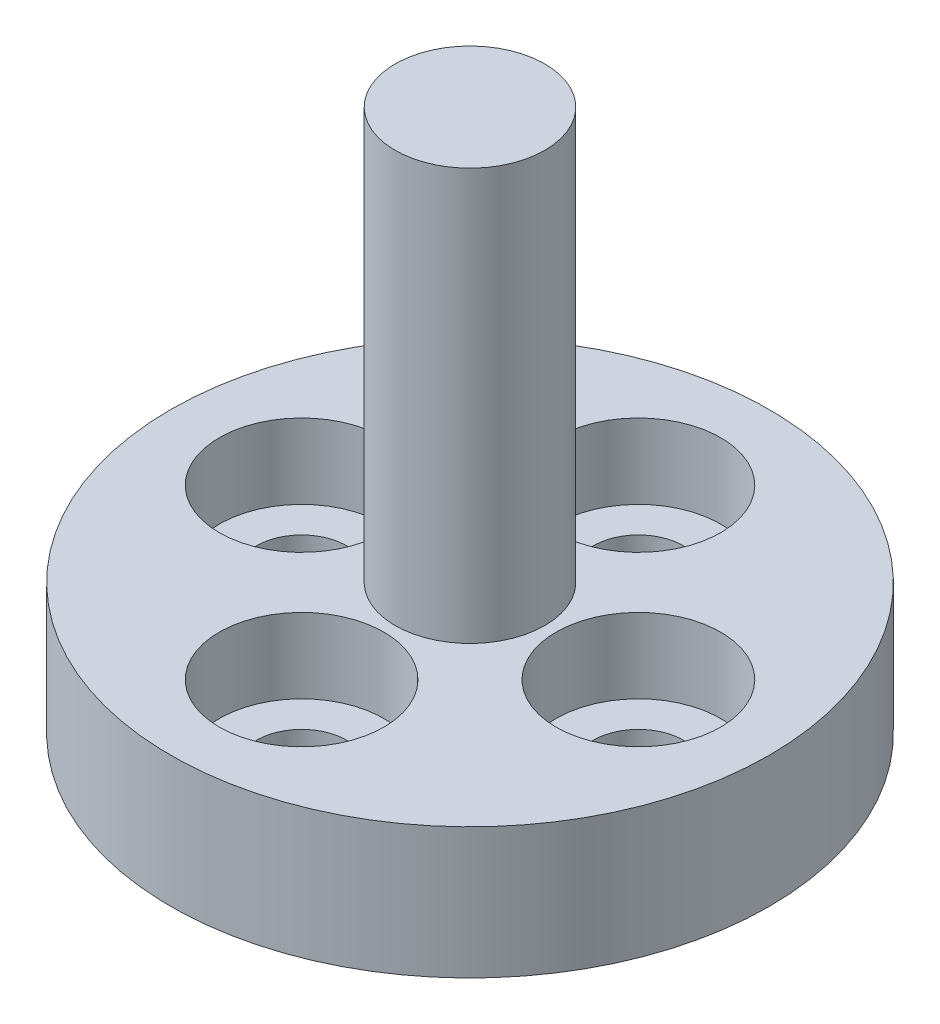
ISO-10303-21;
HEADER;
FILE_DESCRIPTION(('STEP AP214'),'2;1');
FILE_NAME('part.step','',(''),(''),'','','');
FILE_SCHEMA(('AUTOMOTIVE_DESIGN { 1 0 10303 214 1 1 1 1 }'));
ENDSEC;
DATA;
#1=APPLICATION_CONTEXT('core data for automotive mechanical design processes');
#2=APPLICATION_PROTOCOL_DEFINITION('international standard','automotive_design',2000,#1);
#3=PRODUCT_CONTEXT('',#1,'mechanical');
#4=PRODUCT('Part','Part','',(#3));
#5=PRODUCT_RELATED_PRODUCT_CATEGORY('part','',(#4));
#6=PRODUCT_DEFINITION_FORMATION('','',#4);
#7=PRODUCT_DEFINITION_CONTEXT('part definition',#1,'design');
#8=PRODUCT_DEFINITION('design','',#6,#7);
#9=PRODUCT_DEFINITION_SHAPE('','',#8);
#10=(LENGTH_UNIT() NAMED_UNIT(*) SI_UNIT(.MILLI.,.METRE.));
#11=(NAMED_UNIT(*) PLANE_ANGLE_UNIT() SI_UNIT($,.RADIAN.));
#12=(NAMED_UNIT(*) SI_UNIT($,.STERADIAN.) SOLID_ANGLE_UNIT());
#13=UNCERTAINTY_MEASURE_WITH_UNIT(LENGTH_MEASURE(1.E-05),#10,'distance_accuracy_value','');
#14=(GEOMETRIC_REPRESENTATION_CONTEXT(3) GLOBAL_UNCERTAINTY_ASSIGNED_CONTEXT((#13)) GLOBAL_UNIT_ASSIGNED_CONTEXT((#10,
#11,#12)) REPRESENTATION_CONTEXT('',''));
#15=CARTESIAN_POINT('',(0.,0.,0.));
#16=DIRECTION('',(0.,0.,1.));
#17=DIRECTION('',(1.,0.,0.));
#18=AXIS2_PLACEMENT_3D('',#15,#16,#17);
#19=CARTESIAN_POINT('',(8.,0.,0.));
#20=DIRECTION('',(0.,-1.,0.));
#21=DIRECTION('',(1.,0.,0.));
#22=AXIS2_PLACEMENT_3D('',#19,#20,#21);
#23=PLANE('',#22);
#24=CARTESIAN_POINT('',(0.,0.,0.));
#25=DIRECTION('',(0.,-1.,0.));
#26=DIRECTION('',(1.,0.,0.));
#27=AXIS2_PLACEMENT_3D('',#24,#25,#26);
#28=CIRCLE('',#27,2.);
#29=CARTESIAN_POINT('',(2.,0.,0.));
#30=VERTEX_POINT('',#29);
#31=EDGE_CURVE('E10',#30,#30,#28,.F.);
#32=ORIENTED_EDGE('',*,*,#31,.T.);
#33=EDGE_LOOP('',(#32));
#34=FACE_BOUND('',#33,.T.);
#35=CARTESIAN_POINT('',(-4.5,0.,0.));
#36=DIRECTION('',(0.,1.,0.));
#37=DIRECTION('',(0.,0.,1.));
#38=AXIS2_PLACEMENT_3D('',#35,#36,#37);
#39=CIRCLE('',#38,1.2);
#40=CARTESIAN_POINT('',(-4.5,0.,1.2));
#41=VERTEX_POINT('',#40);
#42=EDGE_CURVE('E126',#41,#41,#39,.T.);
#43=ORIENTED_EDGE('',*,*,#42,.T.);
#44=EDGE_LOOP('',(#43));
#45=FACE_BOUND('',#44,.T.);
#46=CARTESIAN_POINT('',(0.,0.,-4.5));
#47=DIRECTION('',(0.,1.,0.));
#48=DIRECTION('',(0.,0.,1.));
#49=AXIS2_PLACEMENT_3D('',#46,#47,#48);
#50=CIRCLE('',#49,1.2);
#51=CARTESIAN_POINT('',(0.,0.,-3.3));
#52=VERTEX_POINT('',#51);
#53=EDGE_CURVE('E110',#52,#52,#50,.T.);
#54=ORIENTED_EDGE('',*,*,#53,.T.);
#55=EDGE_LOOP('',(#54));
#56=FACE_BOUND('',#55,.T.);
#57=CARTESIAN_POINT('',(4.5,0.,0.));
#58=DIRECTION('',(0.,1.,0.));
#59=DIRECTION('',(0.,0.,1.));
#60=AXIS2_PLACEMENT_3D('',#57,#58,#59);
#61=CIRCLE('',#60,1.2);
#62=CARTESIAN_POINT('',(4.5,0.,1.2));
#63=VERTEX_POINT('',#62);
#64=EDGE_CURVE('E94',#63,#63,#61,.T.);
#65=ORIENTED_EDGE('',*,*,#64,.T.);
#66=EDGE_LOOP('',(#65));
#67=FACE_BOUND('',#66,.T.);
#68=CARTESIAN_POINT('',(0.,0.,4.5));
#69=DIRECTION('',(0.,1.,0.));
#70=DIRECTION('',(0.,0.,1.));
#71=AXIS2_PLACEMENT_3D('',#68,#69,#70);
#72=CIRCLE('',#71,1.2);
#73=CARTESIAN_POINT('',(0.,0.,5.7));
#74=VERTEX_POINT('',#73);
#75=EDGE_CURVE('E78',#74,#74,#72,.T.);
#76=ORIENTED_EDGE('',*,*,#75,.T.);
#77=EDGE_LOOP('',(#76));
#78=FACE_BOUND('',#77,.T.);
#79=CARTESIAN_POINT('',(0.,0.,0.));
#80=DIRECTION('',(0.,-1.,0.));
#81=DIRECTION('',(1.,0.,0.));
#82=AXIS2_PLACEMENT_3D('',#79,#80,#81);
#83=CIRCLE('',#82,8.);
#84=CARTESIAN_POINT('',(8.,0.,0.));
#85=VERTEX_POINT('',#84);
#86=EDGE_CURVE('E74',#85,#85,#83,.T.);
#87=ORIENTED_EDGE('',*,*,#86,.T.);
#88=EDGE_LOOP('',(#87));
#89=FACE_BOUND('',#88,.T.);
#90=ADVANCED_FACE('F42',(#34,#45,#56,#67,#78,#89),#23,.T.);
#91=CARTESIAN_POINT('',(0.,14.5,0.));
#92=DIRECTION('',(0.,1.,0.));
#93=DIRECTION('',(-1.,0.,0.));
#94=AXIS2_PLACEMENT_3D('',#91,#92,#93);
#95=PLANE('',#94);
#96=CARTESIAN_POINT('',(0.,14.5,0.));
#97=DIRECTION('',(0.,-1.,0.));
#98=DIRECTION('',(1.,0.,0.));
#99=AXIS2_PLACEMENT_3D('',#96,#97,#98);
#100=CIRCLE('',#99,2.);
#101=CARTESIAN_POINT('',(2.,14.5,0.));
#102=VERTEX_POINT('',#101);
#103=EDGE_CURVE('E60',#102,#102,#100,.T.);
#104=ORIENTED_EDGE('',*,*,#103,.F.);
#105=EDGE_LOOP('',(#104));
#106=FACE_BOUND('',#105,.T.);
#107=ADVANCED_FACE('F168',(#106),#95,.T.);
#108=CARTESIAN_POINT('',(0.,0.,0.));
#109=DIRECTION('',(0.,-1.,0.));
#110=DIRECTION('',(1.,0.,0.));
#111=AXIS2_PLACEMENT_3D('',#108,#109,#110);
#112=CYLINDRICAL_SURFACE('',#111,2.);
#113=ORIENTED_EDGE('',*,*,#103,.T.);
#114=EDGE_LOOP('',(#113));
#115=FACE_BOUND('',#114,.T.);
#116=CARTESIAN_POINT('',(0.,3.5,0.));
#117=DIRECTION('',(0.,-1.,0.));
#118=DIRECTION('',(1.,0.,0.));
#119=AXIS2_PLACEMENT_3D('',#116,#117,#118);
#120=CIRCLE('',#119,2.);
#121=CARTESIAN_POINT('',(2.,3.5,0.));
#122=VERTEX_POINT('',#121);
#123=EDGE_CURVE('E66',#122,#122,#120,.T.);
#124=ORIENTED_EDGE('',*,*,#123,.F.);
#125=EDGE_LOOP('',(#124));
#126=FACE_BOUND('',#125,.T.);
#127=ADVANCED_FACE('F149',(#115,#126),#112,.T.);
#128=CARTESIAN_POINT('',(2.,3.5,0.));
#129=DIRECTION('',(0.,1.,0.));
#130=DIRECTION('',(-1.,0.,0.));
#131=AXIS2_PLACEMENT_3D('',#128,#129,#130);
#132=PLANE('',#131);
#133=CARTESIAN_POINT('',(-4.5,3.5,0.));
#134=DIRECTION('',(0.,1.,0.));
#135=DIRECTION('',(0.,0.,1.));
#136=AXIS2_PLACEMENT_3D('',#133,#134,#135);
#137=CIRCLE('',#136,2.19999999999999);
#138=CARTESIAN_POINT('',(-4.5,3.5,2.19999999999999));
#139=VERTEX_POINT('',#138);
#140=EDGE_CURVE('E138',#139,#139,#137,.T.);
#141=ORIENTED_EDGE('',*,*,#140,.F.);
#142=EDGE_LOOP('',(#141));
#143=FACE_BOUND('',#142,.T.);
#144=CARTESIAN_POINT('',(0.,3.5,-4.5));
#145=DIRECTION('',(0.,1.,0.));
#146=DIRECTION('',(0.,0.,1.));
#147=AXIS2_PLACEMENT_3D('',#144,#145,#146);
#148=CIRCLE('',#147,2.19999999999999);
#149=CARTESIAN_POINT('',(0.,3.5,-2.30000000000001));
#150=VERTEX_POINT('',#149);
#151=EDGE_CURVE('E122',#150,#150,#148,.T.);
#152=ORIENTED_EDGE('',*,*,#151,.F.);
#153=EDGE_LOOP('',(#152));
#154=FACE_BOUND('',#153,.T.);
#155=CARTESIAN_POINT('',(4.5,3.5,0.));
#156=DIRECTION('',(0.,1.,0.));
#157=DIRECTION('',(0.,0.,1.));
#158=AXIS2_PLACEMENT_3D('',#155,#156,#157);
#159=CIRCLE('',#158,2.19999999999999);
#160=CARTESIAN_POINT('',(4.5,3.5,2.19999999999999));
#161=VERTEX_POINT('',#160);
#162=EDGE_CURVE('E106',#161,#161,#159,.T.);
#163=ORIENTED_EDGE('',*,*,#162,.F.);
#164=EDGE_LOOP('',(#163));
#165=FACE_BOUND('',#164,.T.);
#166=CARTESIAN_POINT('',(0.,3.5,4.5));
#167=DIRECTION('',(0.,1.,0.));
#168=DIRECTION('',(0.,0.,1.));
#169=AXIS2_PLACEMENT_3D('',#166,#167,#168);
#170=CIRCLE('',#169,2.19999999999999);
#171=CARTESIAN_POINT('',(0.,3.5,6.69999999999999));
#172=VERTEX_POINT('',#171);
#173=EDGE_CURVE('E90',#172,#172,#170,.T.);
#174=ORIENTED_EDGE('',*,*,#173,.F.);
#175=EDGE_LOOP('',(#174));
#176=FACE_BOUND('',#175,.T.);
#177=ORIENTED_EDGE('',*,*,#123,.T.);
#178=EDGE_LOOP('',(#177));
#179=FACE_BOUND('',#178,.T.);
#180=CARTESIAN_POINT('',(0.,3.5,0.));
#181=DIRECTION('',(0.,-1.,0.));
#182=DIRECTION('',(1.,0.,0.));
#183=AXIS2_PLACEMENT_3D('',#180,#181,#182);
#184=CIRCLE('',#183,8.);
#185=CARTESIAN_POINT('',(8.,3.5,0.));
#186=VERTEX_POINT('',#185);
#187=EDGE_CURVE('E70',#186,#186,#184,.T.);
#188=ORIENTED_EDGE('',*,*,#187,.F.);
#189=EDGE_LOOP('',(#188));
#190=FACE_BOUND('',#189,.T.);
#191=ADVANCED_FACE('F145',(#143,#154,#165,#176,#179,#190),#132,.T.);
#192=CARTESIAN_POINT('',(0.,0.,0.));
#193=DIRECTION('',(0.,-1.,0.));
#194=DIRECTION('',(1.,0.,0.));
#195=AXIS2_PLACEMENT_3D('',#192,#193,#194);
#196=CYLINDRICAL_SURFACE('',#195,8.);
#197=ORIENTED_EDGE('',*,*,#187,.T.);
#198=EDGE_LOOP('',(#197));
#199=FACE_BOUND('',#198,.T.);
#200=ORIENTED_EDGE('',*,*,#86,.F.);
#201=EDGE_LOOP('',(#200));
#202=FACE_BOUND('',#201,.T.);
#203=ADVANCED_FACE('F148',(#199,#202),#196,.T.);
#204=CARTESIAN_POINT('',(0.,3.5,4.5));
#205=DIRECTION('',(0.,1.,0.));
#206=DIRECTION('',(0.,0.,1.));
#207=AXIS2_PLACEMENT_3D('',#204,#205,#206);
#208=CYLINDRICAL_SURFACE('',#207,1.2);
#209=ORIENTED_EDGE('',*,*,#75,.F.);
#210=EDGE_LOOP('',(#209));
#211=FACE_BOUND('',#210,.T.);
#212=CARTESIAN_POINT('',(0.,1.5,4.5));
#213=DIRECTION('',(0.,1.,0.));
#214=DIRECTION('',(0.,0.,1.));
#215=AXIS2_PLACEMENT_3D('',#212,#213,#214);
#216=CIRCLE('',#215,1.2);
#217=CARTESIAN_POINT('',(0.,1.5,5.7));
#218=VERTEX_POINT('',#217);
#219=EDGE_CURVE('E82',#218,#218,#216,.T.);
#220=ORIENTED_EDGE('',*,*,#219,.T.);
#221=EDGE_LOOP('',(#220));
#222=FACE_BOUND('',#221,.T.);
#223=ADVANCED_FACE('F163',(#211,#222),#208,.F.);
#224=CARTESIAN_POINT('',(1.2,1.5,4.5));
#225=DIRECTION('',(0.,-1.,0.));
#226=DIRECTION('',(0.,0.,-1.));
#227=AXIS2_PLACEMENT_3D('',#224,#225,#226);
#228=PLANE('',#227);
#229=ORIENTED_EDGE('',*,*,#219,.F.);
#230=EDGE_LOOP('',(#229));
#231=FACE_BOUND('',#230,.T.);
#232=CARTESIAN_POINT('',(0.,1.5,4.5));
#233=DIRECTION('',(0.,1.,0.));
#234=DIRECTION('',(0.,0.,1.));
#235=AXIS2_PLACEMENT_3D('',#232,#233,#234);
#236=CIRCLE('',#235,2.2);
#237=CARTESIAN_POINT('',(0.,1.5,6.7));
#238=VERTEX_POINT('',#237);
#239=EDGE_CURVE('E86',#238,#238,#236,.T.);
#240=ORIENTED_EDGE('',*,*,#239,.T.);
#241=EDGE_LOOP('',(#240));
#242=FACE_BOUND('',#241,.T.);
#243=ADVANCED_FACE('F230',(#231,#242),#228,.F.);
#244=CARTESIAN_POINT('',(0.,3.5,4.5));
#245=DIRECTION('',(0.,1.,0.));
#246=DIRECTION('',(0.,0.,1.));
#247=AXIS2_PLACEMENT_3D('',#244,#245,#246);
#248=CYLINDRICAL_SURFACE('',#247,2.19999999999999);
#249=ORIENTED_EDGE('',*,*,#239,.F.);
#250=EDGE_LOOP('',(#249));
#251=FACE_BOUND('',#250,.T.);
#252=ORIENTED_EDGE('',*,*,#173,.T.);
#253=EDGE_LOOP('',(#252));
#254=FACE_BOUND('',#253,.T.);
#255=ADVANCED_FACE('F226',(#251,#254),#248,.F.);
#256=CARTESIAN_POINT('',(4.5,3.5,0.));
#257=DIRECTION('',(0.,1.,0.));
#258=DIRECTION('',(0.,0.,1.));
#259=AXIS2_PLACEMENT_3D('',#256,#257,#258);
#260=CYLINDRICAL_SURFACE('',#259,1.2);
#261=ORIENTED_EDGE('',*,*,#64,.F.);
#262=EDGE_LOOP('',(#261));
#263=FACE_BOUND('',#262,.T.);
#264=CARTESIAN_POINT('',(4.5,1.5,0.));
#265=DIRECTION('',(0.,1.,0.));
#266=DIRECTION('',(0.,0.,1.));
#267=AXIS2_PLACEMENT_3D('',#264,#265,#266);
#268=CIRCLE('',#267,1.2);
#269=CARTESIAN_POINT('',(4.5,1.5,1.2));
#270=VERTEX_POINT('',#269);
#271=EDGE_CURVE('E98',#270,#270,#268,.T.);
#272=ORIENTED_EDGE('',*,*,#271,.T.);
#273=EDGE_LOOP('',(#272));
#274=FACE_BOUND('',#273,.T.);
#275=ADVANCED_FACE('F222',(#263,#274),#260,.F.);
#276=CARTESIAN_POINT('',(5.7,1.5,0.));
#277=DIRECTION('',(0.,-1.,0.));
#278=DIRECTION('',(0.,0.,-1.));
#279=AXIS2_PLACEMENT_3D('',#276,#277,#278);
#280=PLANE('',#279);
#281=ORIENTED_EDGE('',*,*,#271,.F.);
#282=EDGE_LOOP('',(#281));
#283=FACE_BOUND('',#282,.T.);
#284=CARTESIAN_POINT('',(4.5,1.5,0.));
#285=DIRECTION('',(0.,1.,0.));
#286=DIRECTION('',(0.,0.,1.));
#287=AXIS2_PLACEMENT_3D('',#284,#285,#286);
#288=CIRCLE('',#287,2.2);
#289=CARTESIAN_POINT('',(4.5,1.5,2.2));
#290=VERTEX_POINT('',#289);
#291=EDGE_CURVE('E102',#290,#290,#288,.T.);
#292=ORIENTED_EDGE('',*,*,#291,.T.);
#293=EDGE_LOOP('',(#292));
#294=FACE_BOUND('',#293,.T.);
#295=ADVANCED_FACE('F218',(#283,#294),#280,.F.);
#296=CARTESIAN_POINT('',(4.5,3.5,0.));
#297=DIRECTION('',(0.,1.,0.));
#298=DIRECTION('',(0.,0.,1.));
#299=AXIS2_PLACEMENT_3D('',#296,#297,#298);
#300=CYLINDRICAL_SURFACE('',#299,2.19999999999999);
#301=ORIENTED_EDGE('',*,*,#291,.F.);
#302=EDGE_LOOP('',(#301));
#303=FACE_BOUND('',#302,.T.);
#304=ORIENTED_EDGE('',*,*,#162,.T.);
#305=EDGE_LOOP('',(#304));
#306=FACE_BOUND('',#305,.T.);
#307=ADVANCED_FACE('F214',(#303,#306),#300,.F.);
#308=CARTESIAN_POINT('',(0.,3.5,-4.5));
#309=DIRECTION('',(0.,1.,0.));
#310=DIRECTION('',(0.,0.,1.));
#311=AXIS2_PLACEMENT_3D('',#308,#309,#310);
#312=CYLINDRICAL_SURFACE('',#311,1.2);
#313=ORIENTED_EDGE('',*,*,#53,.F.);
#314=EDGE_LOOP('',(#313));
#315=FACE_BOUND('',#314,.T.);
#316=CARTESIAN_POINT('',(0.,1.5,-4.5));
#317=DIRECTION('',(0.,1.,0.));
#318=DIRECTION('',(0.,0.,1.));
#319=AXIS2_PLACEMENT_3D('',#316,#317,#318);
#320=CIRCLE('',#319,1.2);
#321=CARTESIAN_POINT('',(0.,1.5,-3.3));
#322=VERTEX_POINT('',#321);
#323=EDGE_CURVE('E114',#322,#322,#320,.T.);
#324=ORIENTED_EDGE('',*,*,#323,.T.);
#325=EDGE_LOOP('',(#324));
#326=FACE_BOUND('',#325,.T.);
#327=ADVANCED_FACE('F210',(#315,#326),#312,.F.);
#328=CARTESIAN_POINT('',(1.2,1.5,-4.5));
#329=DIRECTION('',(0.,-1.,0.));
#330=DIRECTION('',(0.,0.,-1.));
#331=AXIS2_PLACEMENT_3D('',#328,#329,#330);
#332=PLANE('',#331);
#333=ORIENTED_EDGE('',*,*,#323,.F.);
#334=EDGE_LOOP('',(#333));
#335=FACE_BOUND('',#334,.T.);
#336=CARTESIAN_POINT('',(0.,1.5,-4.5));
#337=DIRECTION('',(0.,1.,0.));
#338=DIRECTION('',(0.,0.,1.));
#339=AXIS2_PLACEMENT_3D('',#336,#337,#338);
#340=CIRCLE('',#339,2.2);
#341=CARTESIAN_POINT('',(0.,1.5,-2.3));
#342=VERTEX_POINT('',#341);
#343=EDGE_CURVE('E118',#342,#342,#340,.T.);
#344=ORIENTED_EDGE('',*,*,#343,.T.);
#345=EDGE_LOOP('',(#344));
#346=FACE_BOUND('',#345,.T.);
#347=ADVANCED_FACE('F206',(#335,#346),#332,.F.);
#348=CARTESIAN_POINT('',(0.,3.5,-4.5));
#349=DIRECTION('',(0.,1.,0.));
#350=DIRECTION('',(0.,0.,1.));
#351=AXIS2_PLACEMENT_3D('',#348,#349,#350);
#352=CYLINDRICAL_SURFACE('',#351,2.19999999999999);
#353=ORIENTED_EDGE('',*,*,#343,.F.);
#354=EDGE_LOOP('',(#353));
#355=FACE_BOUND('',#354,.T.);
#356=ORIENTED_EDGE('',*,*,#151,.T.);
#357=EDGE_LOOP('',(#356));
#358=FACE_BOUND('',#357,.T.);
#359=ADVANCED_FACE('F202',(#355,#358),#352,.F.);
#360=CARTESIAN_POINT('',(-4.5,3.5,0.));
#361=DIRECTION('',(0.,1.,0.));
#362=DIRECTION('',(0.,0.,1.));
#363=AXIS2_PLACEMENT_3D('',#360,#361,#362);
#364=CYLINDRICAL_SURFACE('',#363,1.2);
#365=ORIENTED_EDGE('',*,*,#42,.F.);
#366=EDGE_LOOP('',(#365));
#367=FACE_BOUND('',#366,.T.);
#368=CARTESIAN_POINT('',(-4.5,1.5,0.));
#369=DIRECTION('',(0.,1.,0.));
#370=DIRECTION('',(0.,0.,1.));
#371=AXIS2_PLACEMENT_3D('',#368,#369,#370);
#372=CIRCLE('',#371,1.2);
#373=CARTESIAN_POINT('',(-4.5,1.5,1.2));
#374=VERTEX_POINT('',#373);
#375=EDGE_CURVE('E130',#374,#374,#372,.T.);
#376=ORIENTED_EDGE('',*,*,#375,.T.);
#377=EDGE_LOOP('',(#376));
#378=FACE_BOUND('',#377,.T.);
#379=ADVANCED_FACE('F198',(#367,#378),#364,.F.);
#380=CARTESIAN_POINT('',(-3.3,1.5,0.));
#381=DIRECTION('',(0.,-1.,0.));
#382=DIRECTION('',(0.,0.,-1.));
#383=AXIS2_PLACEMENT_3D('',#380,#381,#382);
#384=PLANE('',#383);
#385=ORIENTED_EDGE('',*,*,#375,.F.);
#386=EDGE_LOOP('',(#385));
#387=FACE_BOUND('',#386,.T.);
#388=CARTESIAN_POINT('',(-4.5,1.5,0.));
#389=DIRECTION('',(0.,1.,0.));
#390=DIRECTION('',(0.,0.,1.));
#391=AXIS2_PLACEMENT_3D('',#388,#389,#390);
#392=CIRCLE('',#391,2.2);
#393=CARTESIAN_POINT('',(-4.5,1.5,2.2));
#394=VERTEX_POINT('',#393);
#395=EDGE_CURVE('E134',#394,#394,#392,.T.);
#396=ORIENTED_EDGE('',*,*,#395,.T.);
#397=EDGE_LOOP('',(#396));
#398=FACE_BOUND('',#397,.T.);
#399=ADVANCED_FACE('F191',(#387,#398),#384,.F.);
#400=CARTESIAN_POINT('',(-4.5,3.5,0.));
#401=DIRECTION('',(0.,1.,0.));
#402=DIRECTION('',(0.,0.,1.));
#403=AXIS2_PLACEMENT_3D('',#400,#401,#402);
#404=CYLINDRICAL_SURFACE('',#403,2.19999999999999);
#405=ORIENTED_EDGE('',*,*,#395,.F.);
#406=EDGE_LOOP('',(#405));
#407=FACE_BOUND('',#406,.T.);
#408=ORIENTED_EDGE('',*,*,#140,.T.);
#409=EDGE_LOOP('',(#408));
#410=FACE_BOUND('',#409,.T.);
#411=ADVANCED_FACE('F143',(#407,#410),#404,.F.);
#412=CARTESIAN_POINT('',(0.,14.06,0.));
#413=DIRECTION('',(0.,-1.,0.));
#414=DIRECTION('',(1.,0.,0.));
#415=AXIS2_PLACEMENT_3D('',#412,#413,#414);
#416=CYLINDRICAL_SURFACE('',#415,1.);
#417=CARTESIAN_POINT('',(0.,1.,0.));
#418=DIRECTION('',(0.,-1.,0.));
#419=DIRECTION('',(1.,0.,0.));
#420=AXIS2_PLACEMENT_3D('',#417,#418,#419);
#421=CIRCLE('',#420,1.);
#422=CARTESIAN_POINT('',(1.,1.,0.));
#423=VERTEX_POINT('',#422);
#424=EDGE_CURVE('E50',#423,#423,#421,.T.);
#425=ORIENTED_EDGE('',*,*,#424,.T.);
#426=EDGE_LOOP('',(#425));
#427=FACE_BOUND('',#426,.T.);
#428=CARTESIAN_POINT('',(0.,13.06,0.));
#429=DIRECTION('',(0.,-1.,0.));
#430=DIRECTION('',(1.,0.,0.));
#431=AXIS2_PLACEMENT_3D('',#428,#429,#430);
#432=CIRCLE('',#431,1.);
#433=CARTESIAN_POINT('',(1.,13.06,0.));
#434=VERTEX_POINT('',#433);
#435=EDGE_CURVE('E55',#434,#434,#432,.F.);
#436=ORIENTED_EDGE('',*,*,#435,.T.);
#437=EDGE_LOOP('',(#436));
#438=FACE_BOUND('',#437,.T.);
#439=ADVANCED_FACE('F181',(#427,#438),#416,.F.);
#440=CARTESIAN_POINT('',(0.,1.,0.));
#441=DIRECTION('',(0.,-1.,0.));
#442=DIRECTION('',(1.,0.,0.));
#443=AXIS2_PLACEMENT_3D('',#440,#441,#442);
#444=TOROIDAL_SURFACE('',#443,2.,1.);
#445=ORIENTED_EDGE('',*,*,#31,.F.);
#446=EDGE_LOOP('',(#445));
#447=FACE_BOUND('',#446,.T.);
#448=ORIENTED_EDGE('',*,*,#424,.F.);
#449=EDGE_LOOP('',(#448));
#450=FACE_BOUND('',#449,.T.);
#451=ADVANCED_FACE('F179',(#447,#450),#444,.T.);
#452=CARTESIAN_POINT('',(0.,13.06,0.));
#453=DIRECTION('',(0.,-1.,0.));
#454=DIRECTION('',(1.,0.,0.));
#455=AXIS2_PLACEMENT_3D('',#452,#453,#454);
#456=SPHERICAL_SURFACE('',#455,1.);
#457=ORIENTED_EDGE('',*,*,#435,.F.);
#458=EDGE_LOOP('',(#457));
#459=FACE_BOUND('',#458,.T.);
#460=ADVANCED_FACE('F44',(#459),#456,.F.);
#461=CLOSED_SHELL('',(#90,#107,#127,#191,#203,#223,#243,#255,#275,#295,#307,#327,#347,#359,#379,
#399,#411,#439,#451,#460));
#462=MANIFOLD_SOLID_BREP('B2',#461);
#463=ADVANCED_BREP_SHAPE_REPRESENTATION('',(#18,#462),#14);
#464=SHAPE_DEFINITION_REPRESENTATION(#9,#463);
ENDSEC;
END-ISO-10303-21;
